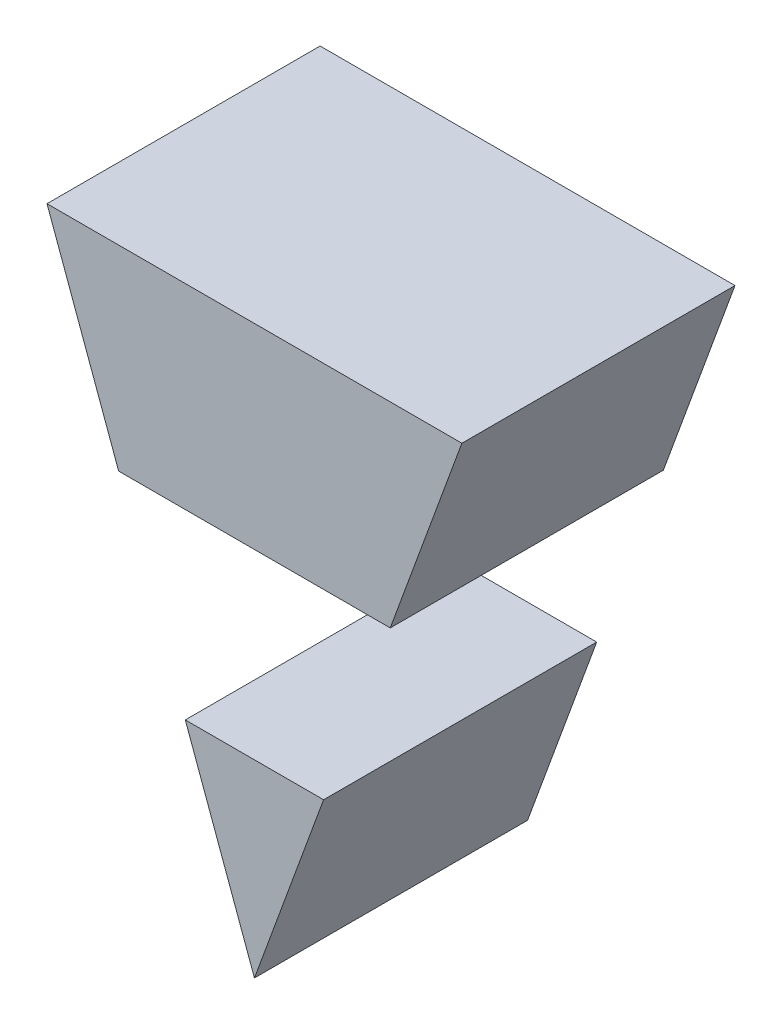
ISO-10303-21;
HEADER;
FILE_DESCRIPTION(('STEP AP214'),'2;1');
FILE_NAME('part.step','',(''),(''),'','','');
FILE_SCHEMA(('AUTOMOTIVE_DESIGN { 1 0 10303 214 1 1 1 1 }'));
ENDSEC;
DATA;
#1=APPLICATION_CONTEXT('core data for automotive mechanical design processes');
#2=APPLICATION_PROTOCOL_DEFINITION('international standard','automotive_design',2000,#1);
#3=PRODUCT_CONTEXT('',#1,'mechanical');
#4=PRODUCT('Part','Part','',(#3));
#5=PRODUCT_RELATED_PRODUCT_CATEGORY('part','',(#4));
#6=PRODUCT_DEFINITION_FORMATION('','',#4);
#7=PRODUCT_DEFINITION_CONTEXT('part definition',#1,'design');
#8=PRODUCT_DEFINITION('design','',#6,#7);
#9=PRODUCT_DEFINITION_SHAPE('','',#8);
#10=(LENGTH_UNIT() NAMED_UNIT(*) SI_UNIT(.MILLI.,.METRE.));
#11=(NAMED_UNIT(*) PLANE_ANGLE_UNIT() SI_UNIT($,.RADIAN.));
#12=(NAMED_UNIT(*) SI_UNIT($,.STERADIAN.) SOLID_ANGLE_UNIT());
#13=UNCERTAINTY_MEASURE_WITH_UNIT(LENGTH_MEASURE(1.E-05),#10,'distance_accuracy_value','');
#14=(GEOMETRIC_REPRESENTATION_CONTEXT(3) GLOBAL_UNCERTAINTY_ASSIGNED_CONTEXT((#13)) GLOBAL_UNIT_ASSIGNED_CONTEXT((#10,
#11,#12)) REPRESENTATION_CONTEXT('',''));
#15=CARTESIAN_POINT('',(0.,0.,0.));
#16=DIRECTION('',(0.,0.,1.));
#17=DIRECTION('',(1.,0.,0.));
#18=AXIS2_PLACEMENT_3D('',#15,#16,#17);
#19=CARTESIAN_POINT('',(-0.09247923496755,-0.06179322686651,0.));
#20=DIRECTION('',(0.,1.,0.));
#21=DIRECTION('',(1.,0.,0.));
#22=AXIS2_PLACEMENT_3D('',#19,#20,#21);
#23=PLANE('',#22);
#24=DIRECTION('',(1.,0.,0.));
#25=VECTOR('',#24,1.);
#26=CARTESIAN_POINT('',(-0.143115988022,-0.06179322686651,0.));
#27=LINE('',#26,#25);
#28=CARTESIAN_POINT('',(-0.143115988022,-0.06179322686651,0.));
#29=VERTEX_POINT('',#28);
#30=CARTESIAN_POINT('',(-0.09247923496755,-0.06179322686651,0.));
#31=VERTEX_POINT('',#30);
#32=EDGE_CURVE('P0_E38',#29,#31,#27,.T.);
#33=ORIENTED_EDGE('',*,*,#32,.F.);
#34=DIRECTION('',(0.,0.,1.));
#35=VECTOR('',#34,1.);
#36=CARTESIAN_POINT('',(-0.143115988022,-0.06179322686651,0.));
#37=LINE('',#36,#35);
#38=CARTESIAN_POINT('',(-0.143115988022,-0.06179322686651,0.1));
#39=VERTEX_POINT('',#38);
#40=EDGE_CURVE('P0_E11',#29,#39,#37,.T.);
#41=ORIENTED_EDGE('',*,*,#40,.T.);
#42=DIRECTION('',(-1.,0.,0.));
#43=VECTOR('',#42,1.);
#44=CARTESIAN_POINT('',(-0.143115988022,-0.06179322686651,0.1));
#45=LINE('',#44,#43);
#46=CARTESIAN_POINT('',(-0.09247923496755,-0.06179322686651,0.1));
#47=VERTEX_POINT('',#46);
#48=EDGE_CURVE('P0_E48',#47,#39,#45,.T.);
#49=ORIENTED_EDGE('',*,*,#48,.F.);
#50=DIRECTION('',(0.,0.,1.));
#51=VECTOR('',#50,1.);
#52=CARTESIAN_POINT('',(-0.09247923496755,-0.06179322686651,0.));
#53=LINE('',#52,#51);
#54=EDGE_CURVE('P0_E20',#31,#47,#53,.T.);
#55=ORIENTED_EDGE('',*,*,#54,.F.);
#56=EDGE_LOOP('',(#33,#41,#49,#55));
#57=FACE_BOUND('',#56,.T.);
#58=ADVANCED_FACE('P0_F17',(#57),#23,.T.);
#59=CARTESIAN_POINT('',(-0.117797611495,-0.130977316953,0.));
#60=DIRECTION('',(0.939091646326967,-0.343666815096988,0.));
#61=DIRECTION('',(0.,0.,-1.));
#62=AXIS2_PLACEMENT_3D('',#59,#60,#61);
#63=PLANE('',#62);
#64=DIRECTION('',(-0.343666815096988,-0.939091646326967,0.));
#65=VECTOR('',#64,1.);
#66=CARTESIAN_POINT('',(-0.09173999406314,-0.05977320361299,0.));
#67=LINE('',#66,#65);
#68=CARTESIAN_POINT('',(-0.117797611495,-0.130977316953,0.));
#69=VERTEX_POINT('',#68);
#70=EDGE_CURVE('P0_E69',#31,#69,#67,.T.);
#71=ORIENTED_EDGE('',*,*,#70,.F.);
#72=ORIENTED_EDGE('',*,*,#54,.T.);
#73=DIRECTION('',(0.343666815096988,0.939091646326967,0.));
#74=VECTOR('',#73,1.);
#75=CARTESIAN_POINT('',(-0.09173999406314,-0.05977320361299,0.1));
#76=LINE('',#75,#74);
#77=CARTESIAN_POINT('',(-0.117797611495,-0.130977316953,0.1));
#78=VERTEX_POINT('',#77);
#79=EDGE_CURVE('P0_E63',#78,#47,#76,.T.);
#80=ORIENTED_EDGE('',*,*,#79,.F.);
#81=DIRECTION('',(0.,0.,1.));
#82=VECTOR('',#81,1.);
#83=CARTESIAN_POINT('',(-0.117797611495,-0.130977316953,0.));
#84=LINE('',#83,#82);
#85=EDGE_CURVE('P0_E76',#69,#78,#84,.T.);
#86=ORIENTED_EDGE('',*,*,#85,.F.);
#87=EDGE_LOOP('',(#71,#72,#80,#86));
#88=FACE_BOUND('',#87,.T.);
#89=ADVANCED_FACE('P0_F77',(#88),#63,.T.);
#90=CARTESIAN_POINT('',(-0.143115988022,-0.06179322686651,0.));
#91=DIRECTION('',(-0.939091646326967,-0.343666815096988,0.));
#92=DIRECTION('',(-0.343666815096988,0.939091646326967,0.));
#93=AXIS2_PLACEMENT_3D('',#90,#91,#92);
#94=PLANE('',#93);
#95=DIRECTION('',(-0.343666815096988,0.939091646326967,0.));
#96=VECTOR('',#95,1.);
#97=CARTESIAN_POINT('',(-0.117797611495,-0.130977316953,0.));
#98=LINE('',#97,#96);
#99=EDGE_CURVE('P0_E72',#69,#29,#98,.T.);
#100=ORIENTED_EDGE('',*,*,#99,.F.);
#101=ORIENTED_EDGE('',*,*,#85,.T.);
#102=DIRECTION('',(0.343666815096988,-0.939091646326967,0.));
#103=VECTOR('',#102,1.);
#104=CARTESIAN_POINT('',(-0.117797611495,-0.130977316953,0.1));
#105=LINE('',#104,#103);
#106=EDGE_CURVE('P0_E74',#39,#78,#105,.T.);
#107=ORIENTED_EDGE('',*,*,#106,.F.);
#108=ORIENTED_EDGE('',*,*,#40,.F.);
#109=EDGE_LOOP('',(#100,#101,#107,#108));
#110=FACE_BOUND('',#109,.T.);
#111=ADVANCED_FACE('P0_F82',(#110),#94,.T.);
#112=CARTESIAN_POINT('',(-0.117797611495,-0.08753773782315,0.));
#113=DIRECTION('',(0.,0.,1.));
#114=DIRECTION('',(1.,0.,0.));
#115=AXIS2_PLACEMENT_3D('',#112,#113,#114);
#116=PLANE('',#115);
#117=ORIENTED_EDGE('',*,*,#99,.T.);
#118=ORIENTED_EDGE('',*,*,#32,.T.);
#119=ORIENTED_EDGE('',*,*,#70,.T.);
#120=EDGE_LOOP('',(#117,#118,#119));
#121=FACE_BOUND('',#120,.T.);
#122=ADVANCED_FACE('P0_F70',(#121),#116,.F.);
#123=CARTESIAN_POINT('',(-0.117797611495,-0.08753773782315,0.1));
#124=DIRECTION('',(0.,0.,1.));
#125=DIRECTION('',(1.,0.,0.));
#126=AXIS2_PLACEMENT_3D('',#123,#124,#125);
#127=PLANE('',#126);
#128=ORIENTED_EDGE('',*,*,#106,.T.);
#129=ORIENTED_EDGE('',*,*,#79,.T.);
#130=ORIENTED_EDGE('',*,*,#48,.T.);
#131=EDGE_LOOP('',(#128,#129,#130));
#132=FACE_BOUND('',#131,.T.);
#133=ADVANCED_FACE('P0_F96',(#132),#127,.T.);
#134=CLOSED_SHELL('',(#58,#89,#111,#122,#133));
#135=MANIFOLD_SOLID_BREP('P0_B1',#134);
#136=CARTESIAN_POINT('',(-0.06807484512104,0.004893335908233,0.));
#137=DIRECTION('',(0.939091646326967,-0.343666815096988,0.));
#138=DIRECTION('',(0.,0.,-1.));
#139=AXIS2_PLACEMENT_3D('',#136,#137,#138);
#140=PLANE('',#139);
#141=DIRECTION('',(0.343666815096988,0.939091646326967,0.));
#142=VECTOR('',#141,1.);
#143=CARTESIAN_POINT('',(-0.06807484512104,0.004893335908233,0.));
#144=LINE('',#143,#142);
#145=CARTESIAN_POINT('',(-0.06807484512104,0.004893335908233,0.));
#146=VERTEX_POINT('',#145);
#147=CARTESIAN_POINT('',(-0.04184248191269,0.07657495330682,0.));
#148=VERTEX_POINT('',#147);
#149=EDGE_CURVE('P1_E11',#146,#148,#144,.T.);
#150=ORIENTED_EDGE('',*,*,#149,.T.);
#151=DIRECTION('',(0.,0.,1.));
#152=VECTOR('',#151,1.);
#153=CARTESIAN_POINT('',(-0.04184248191269,0.07657495330682,0.));
#154=LINE('',#153,#152);
#155=CARTESIAN_POINT('',(-0.04184248191269,0.07657495330682,0.1));
#156=VERTEX_POINT('',#155);
#157=EDGE_CURVE('P1_E21',#148,#156,#154,.T.);
#158=ORIENTED_EDGE('',*,*,#157,.T.);
#159=DIRECTION('',(0.343666815096988,0.939091646326967,0.));
#160=VECTOR('',#159,1.);
#161=CARTESIAN_POINT('',(-0.06807484512104,0.004893335908233,0.1));
#162=LINE('',#161,#160);
#163=CARTESIAN_POINT('',(-0.06807484512104,0.004893335908233,0.1));
#164=VERTEX_POINT('',#163);
#165=EDGE_CURVE('P1_E69',#164,#156,#162,.T.);
#166=ORIENTED_EDGE('',*,*,#165,.F.);
#167=DIRECTION('',(0.,0.,1.));
#168=VECTOR('',#167,1.);
#169=CARTESIAN_POINT('',(-0.06807484512104,0.004893335908233,0.));
#170=LINE('',#169,#168);
#171=EDGE_CURVE('P1_E66',#146,#164,#170,.T.);
#172=ORIENTED_EDGE('',*,*,#171,.F.);
#173=EDGE_LOOP('',(#150,#158,#166,#172));
#174=FACE_BOUND('',#173,.T.);
#175=ADVANCED_FACE('P1_F17',(#174),#140,.T.);
#176=CARTESIAN_POINT('',(-0.167520377869,0.004893335908233,0.));
#177=DIRECTION('',(0.,-1.,0.));
#178=DIRECTION('',(0.,0.,-1.));
#179=AXIS2_PLACEMENT_3D('',#176,#177,#178);
#180=PLANE('',#179);
#181=DIRECTION('',(1.,0.,0.));
#182=VECTOR('',#181,1.);
#183=CARTESIAN_POINT('',(-0.167520377869,0.004893335908233,0.));
#184=LINE('',#183,#182);
#185=CARTESIAN_POINT('',(-0.167520377869,0.004893335908233,0.));
#186=VERTEX_POINT('',#185);
#187=EDGE_CURVE('P1_E74',#186,#146,#184,.T.);
#188=ORIENTED_EDGE('',*,*,#187,.T.);
#189=ORIENTED_EDGE('',*,*,#171,.T.);
#190=DIRECTION('',(1.,0.,0.));
#191=VECTOR('',#190,1.);
#192=CARTESIAN_POINT('',(-0.167520377869,0.004893335908233,0.1));
#193=LINE('',#192,#191);
#194=CARTESIAN_POINT('',(-0.167520377869,0.004893335908233,0.1));
#195=VERTEX_POINT('',#194);
#196=EDGE_CURVE('P1_E106',#195,#164,#193,.T.);
#197=ORIENTED_EDGE('',*,*,#196,.F.);
#198=DIRECTION('',(0.,0.,1.));
#199=VECTOR('',#198,1.);
#200=CARTESIAN_POINT('',(-0.167520377869,0.004893335908233,0.));
#201=LINE('',#200,#199);
#202=EDGE_CURVE('P1_E86',#186,#195,#201,.T.);
#203=ORIENTED_EDGE('',*,*,#202,.F.);
#204=EDGE_LOOP('',(#188,#189,#197,#203));
#205=FACE_BOUND('',#204,.T.);
#206=ADVANCED_FACE('P1_F84',(#205),#180,.T.);
#207=CARTESIAN_POINT('',(-0.193752741077,0.07657495330682,0.));
#208=DIRECTION('',(-0.939091646326967,-0.343666815096988,0.));
#209=DIRECTION('',(-0.343666815096988,0.939091646326967,0.));
#210=AXIS2_PLACEMENT_3D('',#207,#208,#209);
#211=PLANE('',#210);
#212=DIRECTION('',(0.343666815096988,-0.939091646326967,0.));
#213=VECTOR('',#212,1.);
#214=CARTESIAN_POINT('',(-0.193752741077,0.07657495330682,0.));
#215=LINE('',#214,#213);
#216=CARTESIAN_POINT('',(-0.193752741077,0.07657495330682,0.));
#217=VERTEX_POINT('',#216);
#218=EDGE_CURVE('P1_E75',#217,#186,#215,.T.);
#219=ORIENTED_EDGE('',*,*,#218,.T.);
#220=ORIENTED_EDGE('',*,*,#202,.T.);
#221=DIRECTION('',(0.343666815096988,-0.939091646326967,0.));
#222=VECTOR('',#221,1.);
#223=CARTESIAN_POINT('',(-0.193752741077,0.07657495330682,0.1));
#224=LINE('',#223,#222);
#225=CARTESIAN_POINT('',(-0.193752741077,0.07657495330682,0.1));
#226=VERTEX_POINT('',#225);
#227=EDGE_CURVE('P1_E108',#226,#195,#224,.T.);
#228=ORIENTED_EDGE('',*,*,#227,.F.);
#229=DIRECTION('',(0.,0.,1.));
#230=VECTOR('',#229,1.);
#231=CARTESIAN_POINT('',(-0.193752741077,0.07657495330682,0.));
#232=LINE('',#231,#230);
#233=EDGE_CURVE('P1_E97',#217,#226,#232,.T.);
#234=ORIENTED_EDGE('',*,*,#233,.F.);
#235=EDGE_LOOP('',(#219,#220,#228,#234));
#236=FACE_BOUND('',#235,.T.);
#237=ADVANCED_FACE('P1_F118',(#236),#211,.T.);
#238=CARTESIAN_POINT('',(-0.04184248191269,0.07657495330682,0.));
#239=DIRECTION('',(0.,1.,0.));
#240=DIRECTION('',(1.,0.,0.));
#241=AXIS2_PLACEMENT_3D('',#238,#239,#240);
#242=PLANE('',#241);
#243=DIRECTION('',(-1.,0.,0.));
#244=VECTOR('',#243,1.);
#245=CARTESIAN_POINT('',(-0.04184248191269,0.07657495330682,0.));
#246=LINE('',#245,#244);
#247=EDGE_CURVE('P1_E82',#148,#217,#246,.T.);
#248=ORIENTED_EDGE('',*,*,#247,.T.);
#249=ORIENTED_EDGE('',*,*,#233,.T.);
#250=DIRECTION('',(-1.,0.,0.));
#251=VECTOR('',#250,1.);
#252=CARTESIAN_POINT('',(-0.04184248191269,0.07657495330682,0.1));
#253=LINE('',#252,#251);
#254=EDGE_CURVE('P1_E95',#156,#226,#253,.T.);
#255=ORIENTED_EDGE('',*,*,#254,.F.);
#256=ORIENTED_EDGE('',*,*,#157,.F.);
#257=EDGE_LOOP('',(#248,#249,#255,#256));
#258=FACE_BOUND('',#257,.T.);
#259=ADVANCED_FACE('P1_F116',(#258),#242,.T.);
#260=CARTESIAN_POINT('',(-0.117797611495,0.04538834577079,0.1));
#261=DIRECTION('',(0.,0.,1.));
#262=DIRECTION('',(1.,0.,0.));
#263=AXIS2_PLACEMENT_3D('',#260,#261,#262);
#264=PLANE('',#263);
#265=ORIENTED_EDGE('',*,*,#254,.T.);
#266=ORIENTED_EDGE('',*,*,#227,.T.);
#267=ORIENTED_EDGE('',*,*,#196,.T.);
#268=ORIENTED_EDGE('',*,*,#165,.T.);
#269=EDGE_LOOP('',(#265,#266,#267,#268));
#270=FACE_BOUND('',#269,.T.);
#271=ADVANCED_FACE('P1_F19',(#270),#264,.T.);
#272=CARTESIAN_POINT('',(-0.117797611495,0.04538834577079,0.));
#273=DIRECTION('',(0.,0.,1.));
#274=DIRECTION('',(1.,0.,0.));
#275=AXIS2_PLACEMENT_3D('',#272,#273,#274);
#276=PLANE('',#275);
#277=ORIENTED_EDGE('',*,*,#247,.F.);
#278=ORIENTED_EDGE('',*,*,#149,.F.);
#279=ORIENTED_EDGE('',*,*,#187,.F.);
#280=ORIENTED_EDGE('',*,*,#218,.F.);
#281=EDGE_LOOP('',(#277,#278,#279,#280));
#282=FACE_BOUND('',#281,.T.);
#283=ADVANCED_FACE('P1_F79',(#282),#276,.F.);
#284=CLOSED_SHELL('',(#175,#206,#237,#259,#271,#283));
#285=MANIFOLD_SOLID_BREP('P1_B1',#284);
#286=ADVANCED_BREP_SHAPE_REPRESENTATION('',(#18,#135,#285),#14);
#287=SHAPE_DEFINITION_REPRESENTATION(#9,#286);
ENDSEC;
END-ISO-10303-21;
